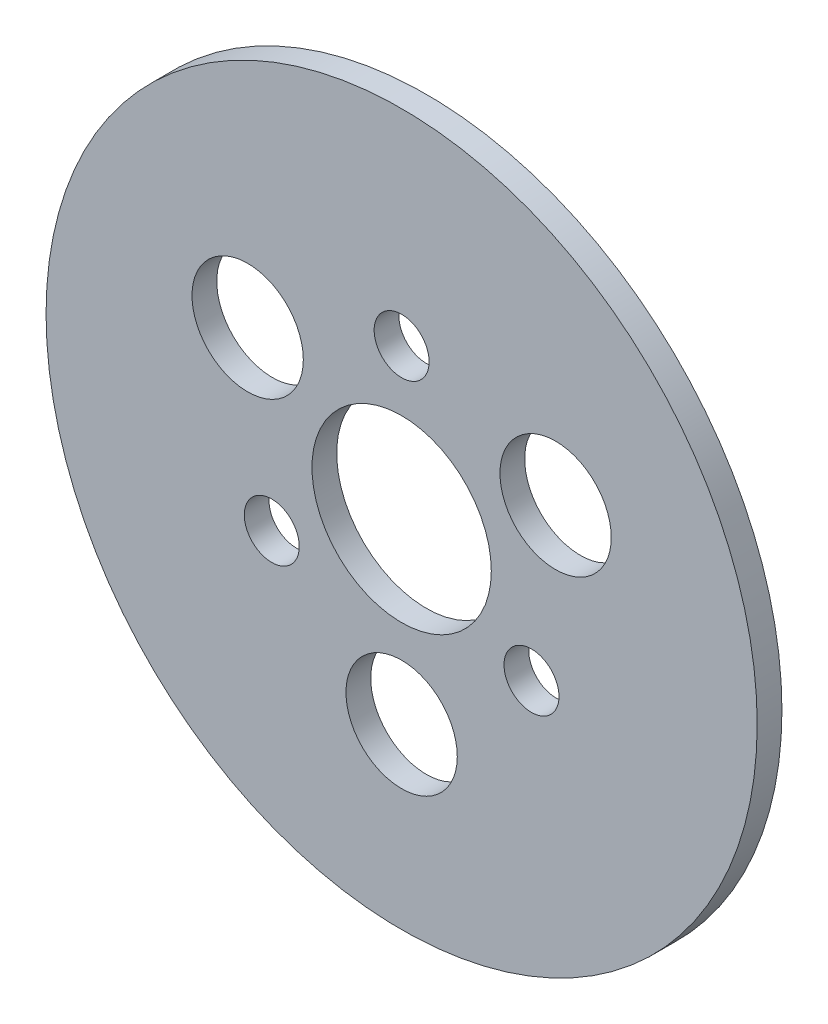
ISO-10303-21;
HEADER;
FILE_DESCRIPTION(('STEP AP214'),'2;1');
FILE_NAME('part.step','',(''),(''),'','','');
FILE_SCHEMA(('AUTOMOTIVE_DESIGN { 1 0 10303 214 1 1 1 1 }'));
ENDSEC;
DATA;
#1=APPLICATION_CONTEXT('core data for automotive mechanical design processes');
#2=APPLICATION_PROTOCOL_DEFINITION('international standard','automotive_design',2000,#1);
#3=PRODUCT_CONTEXT('',#1,'mechanical');
#4=PRODUCT('Part','Part','',(#3));
#5=PRODUCT_RELATED_PRODUCT_CATEGORY('part','',(#4));
#6=PRODUCT_DEFINITION_FORMATION('','',#4);
#7=PRODUCT_DEFINITION_CONTEXT('part definition',#1,'design');
#8=PRODUCT_DEFINITION('design','',#6,#7);
#9=PRODUCT_DEFINITION_SHAPE('','',#8);
#10=(LENGTH_UNIT() NAMED_UNIT(*) SI_UNIT(.MILLI.,.METRE.));
#11=(NAMED_UNIT(*) PLANE_ANGLE_UNIT() SI_UNIT($,.RADIAN.));
#12=(NAMED_UNIT(*) SI_UNIT($,.STERADIAN.) SOLID_ANGLE_UNIT());
#13=UNCERTAINTY_MEASURE_WITH_UNIT(LENGTH_MEASURE(1.E-05),#10,'distance_accuracy_value','');
#14=(GEOMETRIC_REPRESENTATION_CONTEXT(3) GLOBAL_UNCERTAINTY_ASSIGNED_CONTEXT((#13)) GLOBAL_UNIT_ASSIGNED_CONTEXT((#10,
#11,#12)) REPRESENTATION_CONTEXT('',''));
#15=CARTESIAN_POINT('',(0.,0.,0.));
#16=DIRECTION('',(0.,0.,1.));
#17=DIRECTION('',(1.,0.,0.));
#18=AXIS2_PLACEMENT_3D('',#15,#16,#17);
#19=CARTESIAN_POINT('',(0.,0.,2.));
#20=DIRECTION('',(0.,0.,1.));
#21=DIRECTION('',(1.,0.,0.));
#22=AXIS2_PLACEMENT_3D('',#19,#20,#21);
#23=PLANE('',#22);
#24=CARTESIAN_POINT('',(24.8982303588026,14.3750000000001,2.));
#25=DIRECTION('',(0.,0.,1.));
#26=DIRECTION('',(1.,0.,0.));
#27=AXIS2_PLACEMENT_3D('',#24,#25,#26);
#28=CIRCLE('',#27,9.00000000000001);
#29=CARTESIAN_POINT('',(33.8982303588026,14.3750000000001,2.));
#30=VERTEX_POINT('',#29);
#31=EDGE_CURVE('E71',#30,#30,#28,.T.);
#32=ORIENTED_EDGE('',*,*,#31,.F.);
#33=EDGE_LOOP('',(#32));
#34=FACE_BOUND('',#33,.T.);
#35=CARTESIAN_POINT('',(20.9999999999998,-12.1243556529821,2.));
#36=DIRECTION('',(0.,0.,1.));
#37=DIRECTION('',(1.,0.,0.));
#38=AXIS2_PLACEMENT_3D('',#35,#36,#37);
#39=CIRCLE('',#38,4.445);
#40=CARTESIAN_POINT('',(25.4449999999998,-12.1243556529821,2.));
#41=VERTEX_POINT('',#40);
#42=EDGE_CURVE('E59',#41,#41,#39,.T.);
#43=ORIENTED_EDGE('',*,*,#42,.F.);
#44=EDGE_LOOP('',(#43));
#45=FACE_BOUND('',#44,.T.);
#46=CARTESIAN_POINT('',(0.,24.2487113059644,2.));
#47=DIRECTION('',(0.,0.,1.));
#48=DIRECTION('',(1.,0.,0.));
#49=AXIS2_PLACEMENT_3D('',#46,#47,#48);
#50=CIRCLE('',#49,4.445);
#51=CARTESIAN_POINT('',(4.445,24.2487113059644,2.));
#52=VERTEX_POINT('',#51);
#53=EDGE_CURVE('E47',#52,#52,#50,.T.);
#54=ORIENTED_EDGE('',*,*,#53,.F.);
#55=EDGE_LOOP('',(#54));
#56=FACE_BOUND('',#55,.T.);
#57=CARTESIAN_POINT('',(0.,0.,2.));
#58=DIRECTION('',(0.,0.,1.));
#59=DIRECTION('',(1.,0.,0.));
#60=AXIS2_PLACEMENT_3D('',#57,#58,#59);
#61=CIRCLE('',#60,57.5);
#62=CARTESIAN_POINT('',(57.5,0.,2.));
#63=VERTEX_POINT('',#62);
#64=EDGE_CURVE('E10',#63,#63,#61,.T.);
#65=ORIENTED_EDGE('',*,*,#64,.T.);
#66=EDGE_LOOP('',(#65));
#67=FACE_BOUND('',#66,.T.);
#68=CARTESIAN_POINT('',(0.,0.,2.));
#69=DIRECTION('',(0.,0.,1.));
#70=DIRECTION('',(1.,0.,0.));
#71=AXIS2_PLACEMENT_3D('',#68,#69,#70);
#72=CIRCLE('',#71,14.5);
#73=CARTESIAN_POINT('',(14.5,0.,2.));
#74=VERTEX_POINT('',#73);
#75=EDGE_CURVE('E42',#74,#74,#72,.T.);
#76=ORIENTED_EDGE('',*,*,#75,.F.);
#77=EDGE_LOOP('',(#76));
#78=FACE_BOUND('',#77,.T.);
#79=CARTESIAN_POINT('',(-21.0000000000002,-12.1243556529821,2.));
#80=DIRECTION('',(0.,0.,1.));
#81=DIRECTION('',(1.,0.,0.));
#82=AXIS2_PLACEMENT_3D('',#79,#80,#81);
#83=CIRCLE('',#82,4.445);
#84=CARTESIAN_POINT('',(-16.5550000000002,-12.1243556529821,2.));
#85=VERTEX_POINT('',#84);
#86=EDGE_CURVE('E53',#85,#85,#83,.T.);
#87=ORIENTED_EDGE('',*,*,#86,.F.);
#88=EDGE_LOOP('',(#87));
#89=FACE_BOUND('',#88,.T.);
#90=CARTESIAN_POINT('',(-24.8982303588025,14.3750000000002,2.));
#91=DIRECTION('',(0.,0.,1.));
#92=DIRECTION('',(1.,0.,0.));
#93=AXIS2_PLACEMENT_3D('',#90,#91,#92);
#94=CIRCLE('',#93,9.);
#95=CARTESIAN_POINT('',(-15.8982303588025,14.3750000000002,2.));
#96=VERTEX_POINT('',#95);
#97=EDGE_CURVE('E65',#96,#96,#94,.T.);
#98=ORIENTED_EDGE('',*,*,#97,.F.);
#99=EDGE_LOOP('',(#98));
#100=FACE_BOUND('',#99,.T.);
#101=CARTESIAN_POINT('',(0.,-28.75,2.));
#102=DIRECTION('',(0.,0.,1.));
#103=DIRECTION('',(1.,0.,0.));
#104=AXIS2_PLACEMENT_3D('',#101,#102,#103);
#105=CIRCLE('',#104,9.);
#106=CARTESIAN_POINT('',(9.,-28.75,2.));
#107=VERTEX_POINT('',#106);
#108=EDGE_CURVE('E77',#107,#107,#105,.T.);
#109=ORIENTED_EDGE('',*,*,#108,.F.);
#110=EDGE_LOOP('',(#109));
#111=FACE_BOUND('',#110,.T.);
#112=ADVANCED_FACE('F31',(#34,#45,#56,#67,#78,#89,#100,#111),#23,.T.);
#113=CARTESIAN_POINT('',(0.,0.,-2.));
#114=DIRECTION('',(0.,0.,1.));
#115=DIRECTION('',(1.,0.,0.));
#116=AXIS2_PLACEMENT_3D('',#113,#114,#115);
#117=PLANE('',#116);
#118=CARTESIAN_POINT('',(0.,0.,-2.));
#119=DIRECTION('',(0.,0.,1.));
#120=DIRECTION('',(1.,0.,0.));
#121=AXIS2_PLACEMENT_3D('',#118,#119,#120);
#122=CIRCLE('',#121,57.5);
#123=CARTESIAN_POINT('',(57.5,0.,-2.));
#124=VERTEX_POINT('',#123);
#125=EDGE_CURVE('E35',#124,#124,#122,.T.);
#126=ORIENTED_EDGE('',*,*,#125,.F.);
#127=EDGE_LOOP('',(#126));
#128=FACE_BOUND('',#127,.T.);
#129=CARTESIAN_POINT('',(0.,0.,-2.));
#130=DIRECTION('',(0.,0.,1.));
#131=DIRECTION('',(1.,0.,0.));
#132=AXIS2_PLACEMENT_3D('',#129,#130,#131);
#133=CIRCLE('',#132,14.5);
#134=CARTESIAN_POINT('',(14.5,0.,-2.));
#135=VERTEX_POINT('',#134);
#136=EDGE_CURVE('E44',#135,#135,#133,.T.);
#137=ORIENTED_EDGE('',*,*,#136,.T.);
#138=EDGE_LOOP('',(#137));
#139=FACE_BOUND('',#138,.T.);
#140=CARTESIAN_POINT('',(0.,24.2487113059644,-2.));
#141=DIRECTION('',(0.,0.,1.));
#142=DIRECTION('',(1.,0.,0.));
#143=AXIS2_PLACEMENT_3D('',#140,#141,#142);
#144=CIRCLE('',#143,4.445);
#145=CARTESIAN_POINT('',(4.445,24.2487113059644,-2.));
#146=VERTEX_POINT('',#145);
#147=EDGE_CURVE('E50',#146,#146,#144,.T.);
#148=ORIENTED_EDGE('',*,*,#147,.T.);
#149=EDGE_LOOP('',(#148));
#150=FACE_BOUND('',#149,.T.);
#151=CARTESIAN_POINT('',(-21.0000000000002,-12.1243556529821,-2.));
#152=DIRECTION('',(0.,0.,1.));
#153=DIRECTION('',(1.,0.,0.));
#154=AXIS2_PLACEMENT_3D('',#151,#152,#153);
#155=CIRCLE('',#154,4.445);
#156=CARTESIAN_POINT('',(-16.5550000000002,-12.1243556529821,-2.));
#157=VERTEX_POINT('',#156);
#158=EDGE_CURVE('E56',#157,#157,#155,.T.);
#159=ORIENTED_EDGE('',*,*,#158,.T.);
#160=EDGE_LOOP('',(#159));
#161=FACE_BOUND('',#160,.T.);
#162=CARTESIAN_POINT('',(20.9999999999998,-12.1243556529821,-2.));
#163=DIRECTION('',(0.,0.,1.));
#164=DIRECTION('',(1.,0.,0.));
#165=AXIS2_PLACEMENT_3D('',#162,#163,#164);
#166=CIRCLE('',#165,4.445);
#167=CARTESIAN_POINT('',(25.4449999999998,-12.1243556529821,-2.));
#168=VERTEX_POINT('',#167);
#169=EDGE_CURVE('E62',#168,#168,#166,.T.);
#170=ORIENTED_EDGE('',*,*,#169,.T.);
#171=EDGE_LOOP('',(#170));
#172=FACE_BOUND('',#171,.T.);
#173=CARTESIAN_POINT('',(-24.8982303588025,14.3750000000002,-2.));
#174=DIRECTION('',(0.,0.,1.));
#175=DIRECTION('',(1.,0.,0.));
#176=AXIS2_PLACEMENT_3D('',#173,#174,#175);
#177=CIRCLE('',#176,9.);
#178=CARTESIAN_POINT('',(-15.8982303588025,14.3750000000002,-2.));
#179=VERTEX_POINT('',#178);
#180=EDGE_CURVE('E68',#179,#179,#177,.T.);
#181=ORIENTED_EDGE('',*,*,#180,.T.);
#182=EDGE_LOOP('',(#181));
#183=FACE_BOUND('',#182,.T.);
#184=CARTESIAN_POINT('',(24.8982303588026,14.3750000000001,-2.));
#185=DIRECTION('',(0.,0.,1.));
#186=DIRECTION('',(1.,0.,0.));
#187=AXIS2_PLACEMENT_3D('',#184,#185,#186);
#188=CIRCLE('',#187,9.00000000000001);
#189=CARTESIAN_POINT('',(33.8982303588026,14.3750000000001,-2.));
#190=VERTEX_POINT('',#189);
#191=EDGE_CURVE('E74',#190,#190,#188,.T.);
#192=ORIENTED_EDGE('',*,*,#191,.T.);
#193=EDGE_LOOP('',(#192));
#194=FACE_BOUND('',#193,.T.);
#195=CARTESIAN_POINT('',(0.,-28.75,-2.));
#196=DIRECTION('',(0.,0.,1.));
#197=DIRECTION('',(1.,0.,0.));
#198=AXIS2_PLACEMENT_3D('',#195,#196,#197);
#199=CIRCLE('',#198,9.);
#200=CARTESIAN_POINT('',(9.,-28.75,-2.));
#201=VERTEX_POINT('',#200);
#202=EDGE_CURVE('E80',#201,#201,#199,.T.);
#203=ORIENTED_EDGE('',*,*,#202,.T.);
#204=EDGE_LOOP('',(#203));
#205=FACE_BOUND('',#204,.T.);
#206=ADVANCED_FACE('F90',(#128,#139,#150,#161,#172,#183,#194,#205),#117,.F.);
#207=CARTESIAN_POINT('',(0.,0.,2.));
#208=DIRECTION('',(0.,0.,-1.));
#209=DIRECTION('',(-1.,0.,0.));
#210=AXIS2_PLACEMENT_3D('',#207,#208,#209);
#211=CYLINDRICAL_SURFACE('',#210,57.5);
#212=ORIENTED_EDGE('',*,*,#64,.F.);
#213=EDGE_LOOP('',(#212));
#214=FACE_BOUND('',#213,.T.);
#215=ORIENTED_EDGE('',*,*,#125,.T.);
#216=EDGE_LOOP('',(#215));
#217=FACE_BOUND('',#216,.T.);
#218=ADVANCED_FACE('F33',(#214,#217),#211,.T.);
#219=CARTESIAN_POINT('',(0.,0.,2.));
#220=DIRECTION('',(0.,0.,-1.));
#221=DIRECTION('',(-1.,0.,0.));
#222=AXIS2_PLACEMENT_3D('',#219,#220,#221);
#223=CYLINDRICAL_SURFACE('',#222,14.5);
#224=ORIENTED_EDGE('',*,*,#75,.T.);
#225=EDGE_LOOP('',(#224));
#226=FACE_BOUND('',#225,.T.);
#227=ORIENTED_EDGE('',*,*,#136,.F.);
#228=EDGE_LOOP('',(#227));
#229=FACE_BOUND('',#228,.T.);
#230=ADVANCED_FACE('F100',(#226,#229),#223,.F.);
#231=CARTESIAN_POINT('',(0.,24.2487113059644,2.));
#232=DIRECTION('',(0.,0.,-1.));
#233=DIRECTION('',(-1.,0.,0.));
#234=AXIS2_PLACEMENT_3D('',#231,#232,#233);
#235=CYLINDRICAL_SURFACE('',#234,4.445);
#236=ORIENTED_EDGE('',*,*,#53,.T.);
#237=EDGE_LOOP('',(#236));
#238=FACE_BOUND('',#237,.T.);
#239=ORIENTED_EDGE('',*,*,#147,.F.);
#240=EDGE_LOOP('',(#239));
#241=FACE_BOUND('',#240,.T.);
#242=ADVANCED_FACE('F103',(#238,#241),#235,.F.);
#243=CARTESIAN_POINT('',(-21.0000000000002,-12.1243556529821,2.));
#244=DIRECTION('',(0.,0.,-1.));
#245=DIRECTION('',(-1.,0.,0.));
#246=AXIS2_PLACEMENT_3D('',#243,#244,#245);
#247=CYLINDRICAL_SURFACE('',#246,4.445);
#248=ORIENTED_EDGE('',*,*,#86,.T.);
#249=EDGE_LOOP('',(#248));
#250=FACE_BOUND('',#249,.T.);
#251=ORIENTED_EDGE('',*,*,#158,.F.);
#252=EDGE_LOOP('',(#251));
#253=FACE_BOUND('',#252,.T.);
#254=ADVANCED_FACE('F107',(#250,#253),#247,.F.);
#255=CARTESIAN_POINT('',(20.9999999999998,-12.1243556529821,2.));
#256=DIRECTION('',(0.,0.,-1.));
#257=DIRECTION('',(-1.,0.,0.));
#258=AXIS2_PLACEMENT_3D('',#255,#256,#257);
#259=CYLINDRICAL_SURFACE('',#258,4.445);
#260=ORIENTED_EDGE('',*,*,#42,.T.);
#261=EDGE_LOOP('',(#260));
#262=FACE_BOUND('',#261,.T.);
#263=ORIENTED_EDGE('',*,*,#169,.F.);
#264=EDGE_LOOP('',(#263));
#265=FACE_BOUND('',#264,.T.);
#266=ADVANCED_FACE('F111',(#262,#265),#259,.F.);
#267=CARTESIAN_POINT('',(-24.8982303588025,14.3750000000002,2.));
#268=DIRECTION('',(0.,0.,-1.));
#269=DIRECTION('',(-1.,0.,0.));
#270=AXIS2_PLACEMENT_3D('',#267,#268,#269);
#271=CYLINDRICAL_SURFACE('',#270,9.);
#272=ORIENTED_EDGE('',*,*,#97,.T.);
#273=EDGE_LOOP('',(#272));
#274=FACE_BOUND('',#273,.T.);
#275=ORIENTED_EDGE('',*,*,#180,.F.);
#276=EDGE_LOOP('',(#275));
#277=FACE_BOUND('',#276,.T.);
#278=ADVANCED_FACE('F115',(#274,#277),#271,.F.);
#279=CARTESIAN_POINT('',(24.8982303588026,14.3750000000001,2.));
#280=DIRECTION('',(0.,0.,-1.));
#281=DIRECTION('',(-1.,0.,0.));
#282=AXIS2_PLACEMENT_3D('',#279,#280,#281);
#283=CYLINDRICAL_SURFACE('',#282,9.00000000000001);
#284=ORIENTED_EDGE('',*,*,#31,.T.);
#285=EDGE_LOOP('',(#284));
#286=FACE_BOUND('',#285,.T.);
#287=ORIENTED_EDGE('',*,*,#191,.F.);
#288=EDGE_LOOP('',(#287));
#289=FACE_BOUND('',#288,.T.);
#290=ADVANCED_FACE('F119',(#286,#289),#283,.F.);
#291=CARTESIAN_POINT('',(0.,-28.75,2.));
#292=DIRECTION('',(0.,0.,-1.));
#293=DIRECTION('',(-1.,0.,0.));
#294=AXIS2_PLACEMENT_3D('',#291,#292,#293);
#295=CYLINDRICAL_SURFACE('',#294,9.);
#296=ORIENTED_EDGE('',*,*,#108,.T.);
#297=EDGE_LOOP('',(#296));
#298=FACE_BOUND('',#297,.T.);
#299=ORIENTED_EDGE('',*,*,#202,.F.);
#300=EDGE_LOOP('',(#299));
#301=FACE_BOUND('',#300,.T.);
#302=ADVANCED_FACE('F86',(#298,#301),#295,.F.);
#303=CLOSED_SHELL('',(#112,#206,#218,#230,#242,#254,#266,#278,#290,#302));
#304=MANIFOLD_SOLID_BREP('B2',#303);
#305=ADVANCED_BREP_SHAPE_REPRESENTATION('',(#18,#304),#14);
#306=SHAPE_DEFINITION_REPRESENTATION(#9,#305);
ENDSEC;
END-ISO-10303-21;
